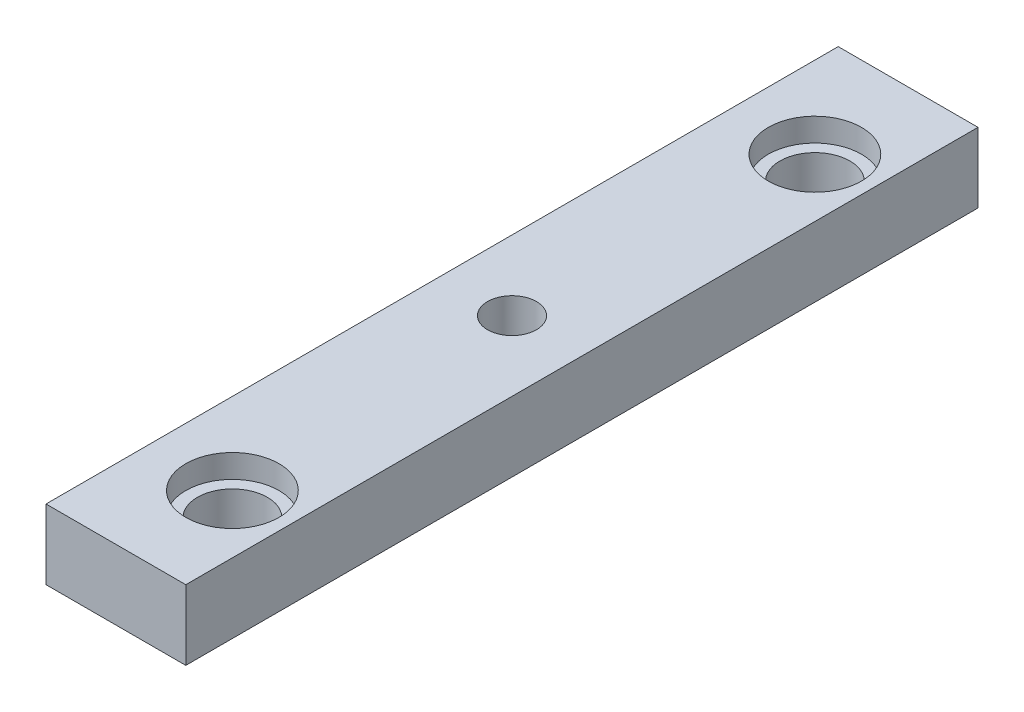
ISO-10303-21;
HEADER;
FILE_DESCRIPTION(('STEP AP214'),'2;1');
FILE_NAME('part.step','',(''),(''),'','','');
FILE_SCHEMA(('AUTOMOTIVE_DESIGN { 1 0 10303 214 1 1 1 1 }'));
ENDSEC;
DATA;
#1=APPLICATION_CONTEXT('core data for automotive mechanical design processes');
#2=APPLICATION_PROTOCOL_DEFINITION('international standard','automotive_design',2000,#1);
#3=PRODUCT_CONTEXT('',#1,'mechanical');
#4=PRODUCT('Part','Part','',(#3));
#5=PRODUCT_RELATED_PRODUCT_CATEGORY('part','',(#4));
#6=PRODUCT_DEFINITION_FORMATION('','',#4);
#7=PRODUCT_DEFINITION_CONTEXT('part definition',#1,'design');
#8=PRODUCT_DEFINITION('design','',#6,#7);
#9=PRODUCT_DEFINITION_SHAPE('','',#8);
#10=(LENGTH_UNIT() NAMED_UNIT(*) SI_UNIT(.MILLI.,.METRE.));
#11=(NAMED_UNIT(*) PLANE_ANGLE_UNIT() SI_UNIT($,.RADIAN.));
#12=(NAMED_UNIT(*) SI_UNIT($,.STERADIAN.) SOLID_ANGLE_UNIT());
#13=UNCERTAINTY_MEASURE_WITH_UNIT(LENGTH_MEASURE(1.E-05),#10,'distance_accuracy_value','');
#14=(GEOMETRIC_REPRESENTATION_CONTEXT(3) GLOBAL_UNCERTAINTY_ASSIGNED_CONTEXT((#13)) GLOBAL_UNIT_ASSIGNED_CONTEXT((#10,
#11,#12)) REPRESENTATION_CONTEXT('',''));
#15=CARTESIAN_POINT('',(0.,0.,0.));
#16=DIRECTION('',(0.,0.,1.));
#17=DIRECTION('',(1.,0.,0.));
#18=AXIS2_PLACEMENT_3D('',#15,#16,#17);
#19=CARTESIAN_POINT('',(1.,-3.,55.));
#20=DIRECTION('',(0.,1.,0.));
#21=DIRECTION('',(-1.,0.,0.));
#22=AXIS2_PLACEMENT_3D('',#19,#20,#21);
#23=CYLINDRICAL_SURFACE('',#22,3.);
#24=CARTESIAN_POINT('',(1.,-3.,55.));
#25=DIRECTION('',(0.,1.,0.));
#26=DIRECTION('',(-1.,0.,0.));
#27=AXIS2_PLACEMENT_3D('',#24,#25,#26);
#28=CIRCLE('',#27,3.);
#29=CARTESIAN_POINT('',(-2.,-3.,55.));
#30=VERTEX_POINT('',#29);
#31=EDGE_CURVE('E119',#30,#30,#28,.T.);
#32=ORIENTED_EDGE('',*,*,#31,.F.);
#33=EDGE_LOOP('',(#32));
#34=FACE_BOUND('',#33,.T.);
#35=CARTESIAN_POINT('',(1.,1.,55.));
#36=DIRECTION('',(0.,1.,0.));
#37=DIRECTION('',(-1.,0.,0.));
#38=AXIS2_PLACEMENT_3D('',#35,#36,#37);
#39=CIRCLE('',#38,3.);
#40=CARTESIAN_POINT('',(-2.,1.,55.));
#41=VERTEX_POINT('',#40);
#42=EDGE_CURVE('E109',#41,#41,#39,.F.);
#43=ORIENTED_EDGE('',*,*,#42,.F.);
#44=EDGE_LOOP('',(#43));
#45=FACE_BOUND('',#44,.T.);
#46=ADVANCED_FACE('F31',(#34,#45),#23,.F.);
#47=CARTESIAN_POINT('',(1.,-3.,5.));
#48=DIRECTION('',(0.,1.,0.));
#49=DIRECTION('',(-1.,0.,0.));
#50=AXIS2_PLACEMENT_3D('',#47,#48,#49);
#51=CYLINDRICAL_SURFACE('',#50,3.);
#52=CARTESIAN_POINT('',(1.,-3.,5.));
#53=DIRECTION('',(0.,1.,0.));
#54=DIRECTION('',(-1.,0.,0.));
#55=AXIS2_PLACEMENT_3D('',#52,#53,#54);
#56=CIRCLE('',#55,3.);
#57=CARTESIAN_POINT('',(-2.,-3.,5.));
#58=VERTEX_POINT('',#57);
#59=EDGE_CURVE('E122',#58,#58,#56,.T.);
#60=ORIENTED_EDGE('',*,*,#59,.F.);
#61=EDGE_LOOP('',(#60));
#62=FACE_BOUND('',#61,.T.);
#63=CARTESIAN_POINT('',(1.,1.,5.));
#64=DIRECTION('',(0.,1.,0.));
#65=DIRECTION('',(-1.,0.,0.));
#66=AXIS2_PLACEMENT_3D('',#63,#64,#65);
#67=CIRCLE('',#66,3.);
#68=CARTESIAN_POINT('',(-2.,1.,5.));
#69=VERTEX_POINT('',#68);
#70=EDGE_CURVE('E115',#69,#69,#67,.F.);
#71=ORIENTED_EDGE('',*,*,#70,.F.);
#72=EDGE_LOOP('',(#71));
#73=FACE_BOUND('',#72,.T.);
#74=ADVANCED_FACE('F135',(#62,#73),#51,.F.);
#75=CARTESIAN_POINT('',(6.,3.,60.));
#76=DIRECTION('',(-1.,0.,0.));
#77=DIRECTION('',(0.,0.,1.));
#78=AXIS2_PLACEMENT_3D('',#75,#76,#77);
#79=PLANE('',#78);
#80=DIRECTION('',(0.,0.,-1.));
#81=VECTOR('',#80,1.);
#82=CARTESIAN_POINT('',(6.,-3.,60.));
#83=LINE('',#82,#81);
#84=CARTESIAN_POINT('',(6.,-3.,64.));
#85=VERTEX_POINT('',#84);
#86=CARTESIAN_POINT('',(6.,-3.,-4.));
#87=VERTEX_POINT('',#86);
#88=EDGE_CURVE('E56',#85,#87,#83,.T.);
#89=ORIENTED_EDGE('',*,*,#88,.T.);
#90=DIRECTION('',(0.,-1.,0.));
#91=VECTOR('',#90,1.);
#92=CARTESIAN_POINT('',(6.,3.,-4.));
#93=LINE('',#92,#91);
#94=CARTESIAN_POINT('',(6.,3.,-4.));
#95=VERTEX_POINT('',#94);
#96=EDGE_CURVE('E75',#95,#87,#93,.T.);
#97=ORIENTED_EDGE('',*,*,#96,.F.);
#98=DIRECTION('',(0.,0.,-1.));
#99=VECTOR('',#98,1.);
#100=CARTESIAN_POINT('',(6.,3.,60.));
#101=LINE('',#100,#99);
#102=CARTESIAN_POINT('',(6.,3.,64.));
#103=VERTEX_POINT('',#102);
#104=EDGE_CURVE('E11',#103,#95,#101,.T.);
#105=ORIENTED_EDGE('',*,*,#104,.F.);
#106=DIRECTION('',(0.,1.,0.));
#107=VECTOR('',#106,1.);
#108=CARTESIAN_POINT('',(6.,3.,64.));
#109=LINE('',#108,#107);
#110=EDGE_CURVE('E74',#85,#103,#109,.T.);
#111=ORIENTED_EDGE('',*,*,#110,.F.);
#112=EDGE_LOOP('',(#89,#97,#105,#111));
#113=FACE_BOUND('',#112,.T.);
#114=ADVANCED_FACE('F33',(#113),#79,.F.);
#115=CARTESIAN_POINT('',(6.,3.,60.));
#116=DIRECTION('',(0.,-1.,0.));
#117=DIRECTION('',(1.,0.,0.));
#118=AXIS2_PLACEMENT_3D('',#115,#116,#117);
#119=PLANE('',#118);
#120=CARTESIAN_POINT('',(0.,3.,30.));
#121=DIRECTION('',(0.,1.,0.));
#122=DIRECTION('',(0.,0.,1.));
#123=AXIS2_PLACEMENT_3D('',#120,#121,#122);
#124=CIRCLE('',#123,2.09999999999999);
#125=CARTESIAN_POINT('',(0.,3.,32.1));
#126=VERTEX_POINT('',#125);
#127=EDGE_CURVE('E92',#126,#126,#124,.T.);
#128=ORIENTED_EDGE('',*,*,#127,.F.);
#129=EDGE_LOOP('',(#128));
#130=FACE_BOUND('',#129,.T.);
#131=CARTESIAN_POINT('',(1.,3.,55.));
#132=DIRECTION('',(0.,1.,0.));
#133=DIRECTION('',(-1.,0.,0.));
#134=AXIS2_PLACEMENT_3D('',#131,#132,#133);
#135=CIRCLE('',#134,4.);
#136=CARTESIAN_POINT('',(-3.,3.,55.));
#137=VERTEX_POINT('',#136);
#138=EDGE_CURVE('E105',#137,#137,#135,.T.);
#139=ORIENTED_EDGE('',*,*,#138,.F.);
#140=EDGE_LOOP('',(#139));
#141=FACE_BOUND('',#140,.T.);
#142=CARTESIAN_POINT('',(1.,3.,5.));
#143=DIRECTION('',(0.,1.,0.));
#144=DIRECTION('',(-1.,0.,0.));
#145=AXIS2_PLACEMENT_3D('',#142,#143,#144);
#146=CIRCLE('',#145,4.);
#147=CARTESIAN_POINT('',(-3.,3.,5.));
#148=VERTEX_POINT('',#147);
#149=EDGE_CURVE('E116',#148,#148,#146,.T.);
#150=ORIENTED_EDGE('',*,*,#149,.F.);
#151=EDGE_LOOP('',(#150));
#152=FACE_BOUND('',#151,.T.);
#153=ORIENTED_EDGE('',*,*,#104,.T.);
#154=DIRECTION('',(1.,0.,0.));
#155=VECTOR('',#154,1.);
#156=CARTESIAN_POINT('',(-6.,3.,-4.));
#157=LINE('',#156,#155);
#158=CARTESIAN_POINT('',(-6.,3.,-4.));
#159=VERTEX_POINT('',#158);
#160=EDGE_CURVE('E100',#159,#95,#157,.T.);
#161=ORIENTED_EDGE('',*,*,#160,.F.);
#162=DIRECTION('',(0.,0.,-1.));
#163=VECTOR('',#162,1.);
#164=CARTESIAN_POINT('',(-6.,3.,60.));
#165=LINE('',#164,#163);
#166=CARTESIAN_POINT('',(-6.,3.,64.));
#167=VERTEX_POINT('',#166);
#168=EDGE_CURVE('E40',#167,#159,#165,.T.);
#169=ORIENTED_EDGE('',*,*,#168,.F.);
#170=DIRECTION('',(-1.,0.,0.));
#171=VECTOR('',#170,1.);
#172=CARTESIAN_POINT('',(6.,3.,64.));
#173=LINE('',#172,#171);
#174=EDGE_CURVE('E80',#103,#167,#173,.T.);
#175=ORIENTED_EDGE('',*,*,#174,.F.);
#176=EDGE_LOOP('',(#153,#161,#169,#175));
#177=FACE_BOUND('',#176,.T.);
#178=ADVANCED_FACE('F81',(#130,#141,#152,#177),#119,.F.);
#179=CARTESIAN_POINT('',(-6.,3.,60.));
#180=DIRECTION('',(1.,0.,0.));
#181=DIRECTION('',(0.,0.,-1.));
#182=AXIS2_PLACEMENT_3D('',#179,#180,#181);
#183=PLANE('',#182);
#184=ORIENTED_EDGE('',*,*,#168,.T.);
#185=DIRECTION('',(0.,1.,0.));
#186=VECTOR('',#185,1.);
#187=CARTESIAN_POINT('',(-6.,3.,-4.));
#188=LINE('',#187,#186);
#189=CARTESIAN_POINT('',(-6.,-3.,-4.));
#190=VERTEX_POINT('',#189);
#191=EDGE_CURVE('E97',#190,#159,#188,.T.);
#192=ORIENTED_EDGE('',*,*,#191,.F.);
#193=DIRECTION('',(0.,0.,-1.));
#194=VECTOR('',#193,1.);
#195=CARTESIAN_POINT('',(-6.,-3.,60.));
#196=LINE('',#195,#194);
#197=CARTESIAN_POINT('',(-6.,-3.,64.));
#198=VERTEX_POINT('',#197);
#199=EDGE_CURVE('E48',#198,#190,#196,.T.);
#200=ORIENTED_EDGE('',*,*,#199,.F.);
#201=DIRECTION('',(0.,-1.,0.));
#202=VECTOR('',#201,1.);
#203=CARTESIAN_POINT('',(-6.,3.,64.));
#204=LINE('',#203,#202);
#205=EDGE_CURVE('E85',#167,#198,#204,.T.);
#206=ORIENTED_EDGE('',*,*,#205,.F.);
#207=EDGE_LOOP('',(#184,#192,#200,#206));
#208=FACE_BOUND('',#207,.T.);
#209=ADVANCED_FACE('F152',(#208),#183,.F.);
#210=CARTESIAN_POINT('',(6.,-3.,60.));
#211=DIRECTION('',(0.,1.,0.));
#212=DIRECTION('',(-1.,0.,0.));
#213=AXIS2_PLACEMENT_3D('',#210,#211,#212);
#214=PLANE('',#213);
#215=CARTESIAN_POINT('',(0.,-3.,30.));
#216=DIRECTION('',(0.,1.,0.));
#217=DIRECTION('',(-1.,0.,0.));
#218=AXIS2_PLACEMENT_3D('',#215,#216,#217);
#219=CIRCLE('',#218,2.09999999999999);
#220=CARTESIAN_POINT('',(-2.09999999999998,-3.,30.));
#221=VERTEX_POINT('',#220);
#222=EDGE_CURVE('E35',#221,#221,#219,.T.);
#223=ORIENTED_EDGE('',*,*,#222,.T.);
#224=EDGE_LOOP('',(#223));
#225=FACE_BOUND('',#224,.T.);
#226=ORIENTED_EDGE('',*,*,#31,.T.);
#227=EDGE_LOOP('',(#226));
#228=FACE_BOUND('',#227,.T.);
#229=ORIENTED_EDGE('',*,*,#59,.T.);
#230=EDGE_LOOP('',(#229));
#231=FACE_BOUND('',#230,.T.);
#232=ORIENTED_EDGE('',*,*,#199,.T.);
#233=DIRECTION('',(-1.,0.,0.));
#234=VECTOR('',#233,1.);
#235=CARTESIAN_POINT('',(-6.,-3.,-4.));
#236=LINE('',#235,#234);
#237=EDGE_CURVE('E103',#87,#190,#236,.T.);
#238=ORIENTED_EDGE('',*,*,#237,.F.);
#239=ORIENTED_EDGE('',*,*,#88,.F.);
#240=DIRECTION('',(1.,0.,0.));
#241=VECTOR('',#240,1.);
#242=CARTESIAN_POINT('',(6.,-3.,64.));
#243=LINE('',#242,#241);
#244=EDGE_CURVE('E89',#198,#85,#243,.T.);
#245=ORIENTED_EDGE('',*,*,#244,.F.);
#246=EDGE_LOOP('',(#232,#238,#239,#245));
#247=FACE_BOUND('',#246,.T.);
#248=ADVANCED_FACE('F148',(#225,#228,#231,#247),#214,.F.);
#249=CARTESIAN_POINT('',(1.,1.,5.));
#250=DIRECTION('',(0.,1.,0.));
#251=DIRECTION('',(-1.,0.,0.));
#252=AXIS2_PLACEMENT_3D('',#249,#250,#251);
#253=PLANE('',#252);
#254=CARTESIAN_POINT('',(1.,1.,5.));
#255=DIRECTION('',(0.,1.,0.));
#256=DIRECTION('',(-1.,0.,0.));
#257=AXIS2_PLACEMENT_3D('',#254,#255,#256);
#258=CIRCLE('',#257,4.);
#259=CARTESIAN_POINT('',(-3.,1.,5.));
#260=VERTEX_POINT('',#259);
#261=EDGE_CURVE('E112',#260,#260,#258,.T.);
#262=ORIENTED_EDGE('',*,*,#261,.T.);
#263=EDGE_LOOP('',(#262));
#264=FACE_BOUND('',#263,.T.);
#265=ORIENTED_EDGE('',*,*,#70,.T.);
#266=EDGE_LOOP('',(#265));
#267=FACE_BOUND('',#266,.T.);
#268=ADVANCED_FACE('F151',(#264,#267),#253,.T.);
#269=CARTESIAN_POINT('',(1.,1.,5.));
#270=DIRECTION('',(0.,1.,0.));
#271=DIRECTION('',(-1.,0.,0.));
#272=AXIS2_PLACEMENT_3D('',#269,#270,#271);
#273=CYLINDRICAL_SURFACE('',#272,4.);
#274=ORIENTED_EDGE('',*,*,#261,.F.);
#275=EDGE_LOOP('',(#274));
#276=FACE_BOUND('',#275,.T.);
#277=ORIENTED_EDGE('',*,*,#149,.T.);
#278=EDGE_LOOP('',(#277));
#279=FACE_BOUND('',#278,.T.);
#280=ADVANCED_FACE('F145',(#276,#279),#273,.F.);
#281=CARTESIAN_POINT('',(1.,1.,55.));
#282=DIRECTION('',(0.,1.,0.));
#283=DIRECTION('',(-1.,0.,0.));
#284=AXIS2_PLACEMENT_3D('',#281,#282,#283);
#285=PLANE('',#284);
#286=CARTESIAN_POINT('',(1.,1.,55.));
#287=DIRECTION('',(0.,1.,0.));
#288=DIRECTION('',(-1.,0.,0.));
#289=AXIS2_PLACEMENT_3D('',#286,#287,#288);
#290=CIRCLE('',#289,4.);
#291=CARTESIAN_POINT('',(-3.,1.,55.));
#292=VERTEX_POINT('',#291);
#293=EDGE_CURVE('E106',#292,#292,#290,.T.);
#294=ORIENTED_EDGE('',*,*,#293,.T.);
#295=EDGE_LOOP('',(#294));
#296=FACE_BOUND('',#295,.T.);
#297=ORIENTED_EDGE('',*,*,#42,.T.);
#298=EDGE_LOOP('',(#297));
#299=FACE_BOUND('',#298,.T.);
#300=ADVANCED_FACE('F132',(#296,#299),#285,.T.);
#301=CARTESIAN_POINT('',(1.,1.,55.));
#302=DIRECTION('',(0.,1.,0.));
#303=DIRECTION('',(-1.,0.,0.));
#304=AXIS2_PLACEMENT_3D('',#301,#302,#303);
#305=CYLINDRICAL_SURFACE('',#304,4.);
#306=ORIENTED_EDGE('',*,*,#293,.F.);
#307=EDGE_LOOP('',(#306));
#308=FACE_BOUND('',#307,.T.);
#309=ORIENTED_EDGE('',*,*,#138,.T.);
#310=EDGE_LOOP('',(#309));
#311=FACE_BOUND('',#310,.T.);
#312=ADVANCED_FACE('F174',(#308,#311),#305,.F.);
#313=CARTESIAN_POINT('',(-6.,-3.,-4.));
#314=DIRECTION('',(0.,0.,1.));
#315=DIRECTION('',(1.,0.,0.));
#316=AXIS2_PLACEMENT_3D('',#313,#314,#315);
#317=PLANE('',#316);
#318=ORIENTED_EDGE('',*,*,#191,.T.);
#319=ORIENTED_EDGE('',*,*,#160,.T.);
#320=ORIENTED_EDGE('',*,*,#96,.T.);
#321=ORIENTED_EDGE('',*,*,#237,.T.);
#322=EDGE_LOOP('',(#318,#319,#320,#321));
#323=FACE_BOUND('',#322,.T.);
#324=ADVANCED_FACE('F186',(#323),#317,.F.);
#325=CARTESIAN_POINT('',(6.,-3.,64.));
#326=DIRECTION('',(0.,0.,-1.));
#327=DIRECTION('',(-1.,0.,0.));
#328=AXIS2_PLACEMENT_3D('',#325,#326,#327);
#329=PLANE('',#328);
#330=ORIENTED_EDGE('',*,*,#110,.T.);
#331=ORIENTED_EDGE('',*,*,#174,.T.);
#332=ORIENTED_EDGE('',*,*,#205,.T.);
#333=ORIENTED_EDGE('',*,*,#244,.T.);
#334=EDGE_LOOP('',(#330,#331,#332,#333));
#335=FACE_BOUND('',#334,.T.);
#336=ADVANCED_FACE('F88',(#335),#329,.F.);
#337=CARTESIAN_POINT('',(0.,3.,30.));
#338=DIRECTION('',(0.,1.,0.));
#339=DIRECTION('',(0.,0.,1.));
#340=AXIS2_PLACEMENT_3D('',#337,#338,#339);
#341=CYLINDRICAL_SURFACE('',#340,2.09999999999999);
#342=ORIENTED_EDGE('',*,*,#127,.T.);
#343=EDGE_LOOP('',(#342));
#344=FACE_BOUND('',#343,.T.);
#345=ORIENTED_EDGE('',*,*,#222,.F.);
#346=EDGE_LOOP('',(#345));
#347=FACE_BOUND('',#346,.T.);
#348=ADVANCED_FACE('F194',(#344,#347),#341,.F.);
#349=CLOSED_SHELL('',(#46,#74,#114,#178,#209,#248,#268,#280,#300,#312,#324,#336,#348));
#350=MANIFOLD_SOLID_BREP('B2',#349);
#351=ADVANCED_BREP_SHAPE_REPRESENTATION('',(#18,#350),#14);
#352=SHAPE_DEFINITION_REPRESENTATION(#9,#351);
ENDSEC;
END-ISO-10303-21;
